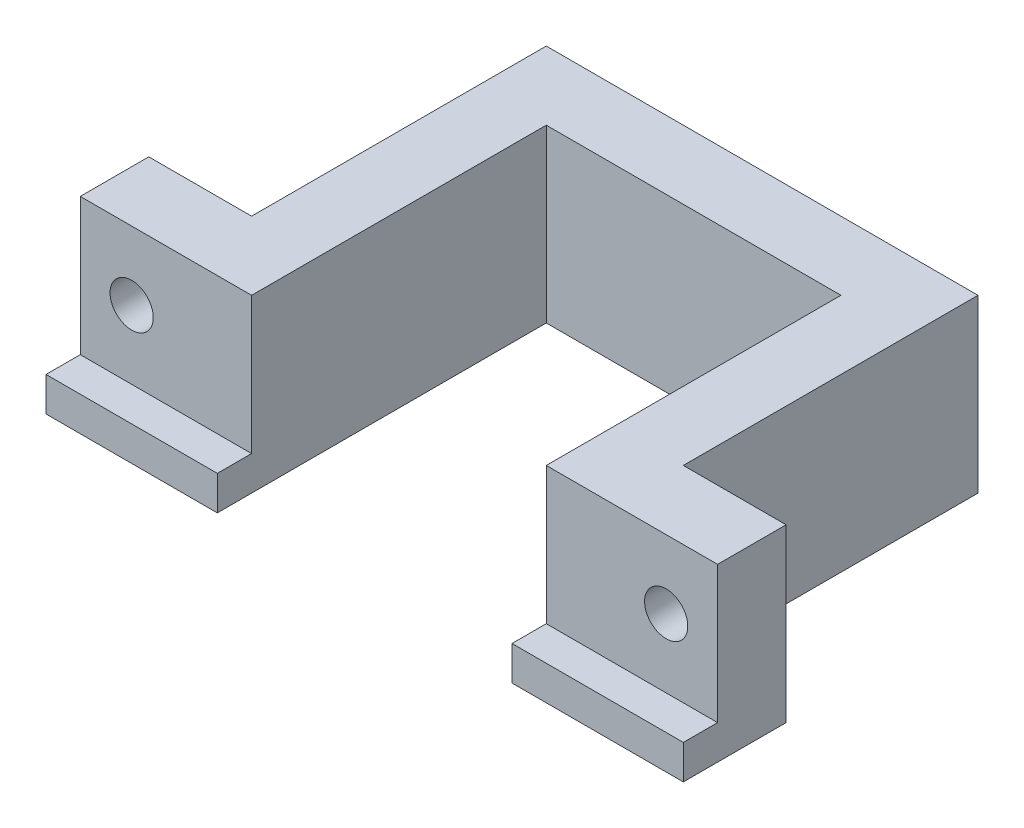
ISO-10303-21;
HEADER;
FILE_DESCRIPTION(('STEP AP214'),'2;1');
FILE_NAME('part.step','',(''),(''),'','','');
FILE_SCHEMA(('AUTOMOTIVE_DESIGN { 1 0 10303 214 1 1 1 1 }'));
ENDSEC;
DATA;
#1=APPLICATION_CONTEXT('core data for automotive mechanical design processes');
#2=APPLICATION_PROTOCOL_DEFINITION('international standard','automotive_design',2000,#1);
#3=PRODUCT_CONTEXT('',#1,'mechanical');
#4=PRODUCT('Part','Part','',(#3));
#5=PRODUCT_RELATED_PRODUCT_CATEGORY('part','',(#4));
#6=PRODUCT_DEFINITION_FORMATION('','',#4);
#7=PRODUCT_DEFINITION_CONTEXT('part definition',#1,'design');
#8=PRODUCT_DEFINITION('design','',#6,#7);
#9=PRODUCT_DEFINITION_SHAPE('','',#8);
#10=(LENGTH_UNIT() NAMED_UNIT(*) SI_UNIT(.MILLI.,.METRE.));
#11=(NAMED_UNIT(*) PLANE_ANGLE_UNIT() SI_UNIT($,.RADIAN.));
#12=(NAMED_UNIT(*) SI_UNIT($,.STERADIAN.) SOLID_ANGLE_UNIT());
#13=UNCERTAINTY_MEASURE_WITH_UNIT(LENGTH_MEASURE(1.E-05),#10,'distance_accuracy_value','');
#14=(GEOMETRIC_REPRESENTATION_CONTEXT(3) GLOBAL_UNCERTAINTY_ASSIGNED_CONTEXT((#13)) GLOBAL_UNIT_ASSIGNED_CONTEXT((#10,
#11,#12)) REPRESENTATION_CONTEXT('',''));
#15=CARTESIAN_POINT('',(0.,0.,0.));
#16=DIRECTION('',(0.,0.,1.));
#17=DIRECTION('',(1.,0.,0.));
#18=AXIS2_PLACEMENT_3D('',#15,#16,#17);
#19=CARTESIAN_POINT('',(60.5,10.,0.));
#20=DIRECTION('',(0.,0.,-1.));
#21=DIRECTION('',(-1.,0.,0.));
#22=AXIS2_PLACEMENT_3D('',#19,#20,#21);
#23=CYLINDRICAL_SURFACE('',#22,3.15);
#24=CARTESIAN_POINT('',(60.5,10.,0.));
#25=DIRECTION('',(0.,0.,-1.));
#26=DIRECTION('',(-1.,0.,0.));
#27=AXIS2_PLACEMENT_3D('',#24,#25,#26);
#28=CIRCLE('',#27,3.15);
#29=CARTESIAN_POINT('',(57.35,10.,0.));
#30=VERTEX_POINT('',#29);
#31=EDGE_CURVE('E234',#30,#30,#28,.T.);
#32=ORIENTED_EDGE('',*,*,#31,.F.);
#33=EDGE_LOOP('',(#32));
#34=FACE_BOUND('',#33,.T.);
#35=CARTESIAN_POINT('',(60.5,10.,-6.));
#36=DIRECTION('',(0.,0.,-1.));
#37=DIRECTION('',(-1.,0.,0.));
#38=AXIS2_PLACEMENT_3D('',#35,#36,#37);
#39=CIRCLE('',#38,3.15);
#40=CARTESIAN_POINT('',(57.35,10.,-6.));
#41=VERTEX_POINT('',#40);
#42=EDGE_CURVE('E37',#41,#41,#39,.F.);
#43=ORIENTED_EDGE('',*,*,#42,.F.);
#44=EDGE_LOOP('',(#43));
#45=FACE_BOUND('',#44,.T.);
#46=ADVANCED_FACE('F33',(#34,#45),#23,.F.);
#47=CARTESIAN_POINT('',(-17.5,10.,0.));
#48=DIRECTION('',(0.,0.,-1.));
#49=DIRECTION('',(-1.,0.,0.));
#50=AXIS2_PLACEMENT_3D('',#47,#48,#49);
#51=CYLINDRICAL_SURFACE('',#50,3.15);
#52=CARTESIAN_POINT('',(-17.5,10.,0.));
#53=DIRECTION('',(0.,0.,-1.));
#54=DIRECTION('',(-1.,0.,0.));
#55=AXIS2_PLACEMENT_3D('',#52,#53,#54);
#56=CIRCLE('',#55,3.15);
#57=CARTESIAN_POINT('',(-20.65,10.,0.));
#58=VERTEX_POINT('',#57);
#59=EDGE_CURVE('E231',#58,#58,#56,.T.);
#60=ORIENTED_EDGE('',*,*,#59,.F.);
#61=EDGE_LOOP('',(#60));
#62=FACE_BOUND('',#61,.T.);
#63=CARTESIAN_POINT('',(-17.5,10.,-6.));
#64=DIRECTION('',(0.,0.,-1.));
#65=DIRECTION('',(-1.,0.,0.));
#66=AXIS2_PLACEMENT_3D('',#63,#64,#65);
#67=CIRCLE('',#66,3.15);
#68=CARTESIAN_POINT('',(-20.65,10.,-6.));
#69=VERTEX_POINT('',#68);
#70=EDGE_CURVE('E227',#69,#69,#67,.F.);
#71=ORIENTED_EDGE('',*,*,#70,.F.);
#72=EDGE_LOOP('',(#71));
#73=FACE_BOUND('',#72,.T.);
#74=ADVANCED_FACE('F290',(#62,#73),#51,.F.);
#75=CARTESIAN_POINT('',(-25.,20.,0.));
#76=DIRECTION('',(0.,0.,-1.));
#77=DIRECTION('',(-1.,0.,0.));
#78=AXIS2_PLACEMENT_3D('',#75,#76,#77);
#79=PLANE('',#78);
#80=ORIENTED_EDGE('',*,*,#59,.T.);
#81=EDGE_LOOP('',(#80));
#82=FACE_BOUND('',#81,.T.);
#83=DIRECTION('',(1.,0.,0.));
#84=VECTOR('',#83,1.);
#85=CARTESIAN_POINT('',(-25.,0.,0.));
#86=LINE('',#85,#84);
#87=CARTESIAN_POINT('',(-25.,0.,0.));
#88=VERTEX_POINT('',#87);
#89=CARTESIAN_POINT('',(0.,0.,0.));
#90=VERTEX_POINT('',#89);
#91=EDGE_CURVE('E237',#88,#90,#86,.T.);
#92=ORIENTED_EDGE('',*,*,#91,.T.);
#93=DIRECTION('',(0.,-1.,0.));
#94=VECTOR('',#93,1.);
#95=CARTESIAN_POINT('',(0.,20.,0.));
#96=LINE('',#95,#94);
#97=CARTESIAN_POINT('',(0.,20.,0.));
#98=VERTEX_POINT('',#97);
#99=EDGE_CURVE('E11',#98,#90,#96,.T.);
#100=ORIENTED_EDGE('',*,*,#99,.F.);
#101=DIRECTION('',(1.,0.,0.));
#102=VECTOR('',#101,1.);
#103=CARTESIAN_POINT('',(-25.,20.,0.));
#104=LINE('',#103,#102);
#105=CARTESIAN_POINT('',(-25.,20.,0.));
#106=VERTEX_POINT('',#105);
#107=EDGE_CURVE('E238',#106,#98,#104,.T.);
#108=ORIENTED_EDGE('',*,*,#107,.F.);
#109=DIRECTION('',(0.,-1.,0.));
#110=VECTOR('',#109,1.);
#111=CARTESIAN_POINT('',(-25.,20.,0.));
#112=LINE('',#111,#110);
#113=EDGE_CURVE('E153',#106,#88,#112,.T.);
#114=ORIENTED_EDGE('',*,*,#113,.T.);
#115=EDGE_LOOP('',(#92,#100,#108,#114));
#116=FACE_BOUND('',#115,.T.);
#117=ADVANCED_FACE('F35',(#82,#116),#79,.F.);
#118=CARTESIAN_POINT('',(0.,20.,0.));
#119=DIRECTION('',(-1.,0.,0.));
#120=DIRECTION('',(0.,0.,1.));
#121=AXIS2_PLACEMENT_3D('',#118,#119,#120);
#122=PLANE('',#121);
#123=ORIENTED_EDGE('',*,*,#99,.T.);
#124=DIRECTION('',(0.,0.,1.));
#125=VECTOR('',#124,1.);
#126=CARTESIAN_POINT('',(0.,0.,-43.));
#127=LINE('',#126,#125);
#128=CARTESIAN_POINT('',(0.,0.,5.));
#129=VERTEX_POINT('',#128);
#130=EDGE_CURVE('E170',#90,#129,#127,.T.);
#131=ORIENTED_EDGE('',*,*,#130,.T.);
#132=DIRECTION('',(0.,1.,0.));
#133=VECTOR('',#132,1.);
#134=CARTESIAN_POINT('',(0.,-5.,5.));
#135=LINE('',#134,#133);
#136=CARTESIAN_POINT('',(0.,-5.,5.));
#137=VERTEX_POINT('',#136);
#138=EDGE_CURVE('E209',#137,#129,#135,.T.);
#139=ORIENTED_EDGE('',*,*,#138,.F.);
#140=DIRECTION('',(0.,0.,1.));
#141=VECTOR('',#140,1.);
#142=CARTESIAN_POINT('',(0.,-5.,-43.));
#143=LINE('',#142,#141);
#144=CARTESIAN_POINT('',(0.,-5.,-43.));
#145=VERTEX_POINT('',#144);
#146=EDGE_CURVE('E193',#145,#137,#143,.T.);
#147=ORIENTED_EDGE('',*,*,#146,.F.);
#148=DIRECTION('',(0.,-1.,0.));
#149=VECTOR('',#148,1.);
#150=CARTESIAN_POINT('',(0.,20.,-43.));
#151=LINE('',#150,#149);
#152=CARTESIAN_POINT('',(0.,20.,-43.));
#153=VERTEX_POINT('',#152);
#154=EDGE_CURVE('E43',#153,#145,#151,.T.);
#155=ORIENTED_EDGE('',*,*,#154,.F.);
#156=DIRECTION('',(0.,0.,-1.));
#157=VECTOR('',#156,1.);
#158=CARTESIAN_POINT('',(0.,20.,0.));
#159=LINE('',#158,#157);
#160=EDGE_CURVE('E240',#98,#153,#159,.T.);
#161=ORIENTED_EDGE('',*,*,#160,.F.);
#162=EDGE_LOOP('',(#123,#131,#139,#147,#155,#161));
#163=FACE_BOUND('',#162,.T.);
#164=ADVANCED_FACE('F298',(#163),#122,.F.);
#165=CARTESIAN_POINT('',(0.,20.,-43.));
#166=DIRECTION('',(0.,0.,-1.));
#167=DIRECTION('',(-1.,0.,0.));
#168=AXIS2_PLACEMENT_3D('',#165,#166,#167);
#169=PLANE('',#168);
#170=ORIENTED_EDGE('',*,*,#154,.T.);
#171=DIRECTION('',(-1.,0.,0.));
#172=VECTOR('',#171,1.);
#173=CARTESIAN_POINT('',(43.,-5.,-43.));
#174=LINE('',#173,#172);
#175=CARTESIAN_POINT('',(43.,-5.,-43.));
#176=VERTEX_POINT('',#175);
#177=EDGE_CURVE('E190',#176,#145,#174,.T.);
#178=ORIENTED_EDGE('',*,*,#177,.F.);
#179=DIRECTION('',(0.,-1.,0.));
#180=VECTOR('',#179,1.);
#181=CARTESIAN_POINT('',(43.,20.,-43.));
#182=LINE('',#181,#180);
#183=CARTESIAN_POINT('',(43.,20.,-43.));
#184=VERTEX_POINT('',#183);
#185=EDGE_CURVE('E283',#184,#176,#182,.T.);
#186=ORIENTED_EDGE('',*,*,#185,.F.);
#187=DIRECTION('',(1.,0.,0.));
#188=VECTOR('',#187,1.);
#189=CARTESIAN_POINT('',(0.,20.,-43.));
#190=LINE('',#189,#188);
#191=EDGE_CURVE('E243',#153,#184,#190,.T.);
#192=ORIENTED_EDGE('',*,*,#191,.F.);
#193=EDGE_LOOP('',(#170,#178,#186,#192));
#194=FACE_BOUND('',#193,.T.);
#195=ADVANCED_FACE('F342',(#194),#169,.F.);
#196=CARTESIAN_POINT('',(43.,20.,-43.));
#197=DIRECTION('',(1.,0.,0.));
#198=DIRECTION('',(0.,0.,-1.));
#199=AXIS2_PLACEMENT_3D('',#196,#197,#198);
#200=PLANE('',#199);
#201=ORIENTED_EDGE('',*,*,#185,.T.);
#202=DIRECTION('',(0.,0.,-1.));
#203=VECTOR('',#202,1.);
#204=CARTESIAN_POINT('',(43.,-5.,5.));
#205=LINE('',#204,#203);
#206=CARTESIAN_POINT('',(43.,-5.,5.));
#207=VERTEX_POINT('',#206);
#208=EDGE_CURVE('E187',#207,#176,#205,.T.);
#209=ORIENTED_EDGE('',*,*,#208,.F.);
#210=DIRECTION('',(0.,1.,0.));
#211=VECTOR('',#210,1.);
#212=CARTESIAN_POINT('',(43.,-5.,5.));
#213=LINE('',#212,#211);
#214=CARTESIAN_POINT('',(43.,0.,5.));
#215=VERTEX_POINT('',#214);
#216=EDGE_CURVE('E212',#207,#215,#213,.T.);
#217=ORIENTED_EDGE('',*,*,#216,.T.);
#218=DIRECTION('',(0.,0.,-1.));
#219=VECTOR('',#218,1.);
#220=CARTESIAN_POINT('',(43.,0.,5.));
#221=LINE('',#220,#219);
#222=CARTESIAN_POINT('',(43.,0.,0.));
#223=VERTEX_POINT('',#222);
#224=EDGE_CURVE('E204',#215,#223,#221,.T.);
#225=ORIENTED_EDGE('',*,*,#224,.T.);
#226=DIRECTION('',(0.,-1.,0.));
#227=VECTOR('',#226,1.);
#228=CARTESIAN_POINT('',(43.,20.,0.));
#229=LINE('',#228,#227);
#230=CARTESIAN_POINT('',(43.,20.,0.));
#231=VERTEX_POINT('',#230);
#232=EDGE_CURVE('E280',#231,#223,#229,.T.);
#233=ORIENTED_EDGE('',*,*,#232,.F.);
#234=DIRECTION('',(0.,0.,1.));
#235=VECTOR('',#234,1.);
#236=CARTESIAN_POINT('',(43.,20.,-43.));
#237=LINE('',#236,#235);
#238=EDGE_CURVE('E245',#184,#231,#237,.T.);
#239=ORIENTED_EDGE('',*,*,#238,.F.);
#240=EDGE_LOOP('',(#201,#209,#217,#225,#233,#239));
#241=FACE_BOUND('',#240,.T.);
#242=ADVANCED_FACE('F338',(#241),#200,.F.);
#243=CARTESIAN_POINT('',(43.,20.,0.));
#244=DIRECTION('',(0.,0.,-1.));
#245=DIRECTION('',(-1.,0.,0.));
#246=AXIS2_PLACEMENT_3D('',#243,#244,#245);
#247=PLANE('',#246);
#248=ORIENTED_EDGE('',*,*,#31,.T.);
#249=EDGE_LOOP('',(#248));
#250=FACE_BOUND('',#249,.T.);
#251=DIRECTION('',(1.,0.,0.));
#252=VECTOR('',#251,1.);
#253=CARTESIAN_POINT('',(43.,0.,0.));
#254=LINE('',#253,#252);
#255=CARTESIAN_POINT('',(68.,0.,0.));
#256=VERTEX_POINT('',#255);
#257=EDGE_CURVE('E241',#223,#256,#254,.T.);
#258=ORIENTED_EDGE('',*,*,#257,.T.);
#259=DIRECTION('',(0.,-1.,0.));
#260=VECTOR('',#259,1.);
#261=CARTESIAN_POINT('',(68.,20.,0.));
#262=LINE('',#261,#260);
#263=CARTESIAN_POINT('',(68.,20.,0.));
#264=VERTEX_POINT('',#263);
#265=EDGE_CURVE('E277',#264,#256,#262,.T.);
#266=ORIENTED_EDGE('',*,*,#265,.F.);
#267=DIRECTION('',(1.,0.,0.));
#268=VECTOR('',#267,1.);
#269=CARTESIAN_POINT('',(43.,20.,0.));
#270=LINE('',#269,#268);
#271=EDGE_CURVE('E247',#231,#264,#270,.T.);
#272=ORIENTED_EDGE('',*,*,#271,.F.);
#273=ORIENTED_EDGE('',*,*,#232,.T.);
#274=EDGE_LOOP('',(#258,#266,#272,#273));
#275=FACE_BOUND('',#274,.T.);
#276=ADVANCED_FACE('F334',(#250,#275),#247,.F.);
#277=CARTESIAN_POINT('',(68.,20.,0.));
#278=DIRECTION('',(-1.,0.,0.));
#279=DIRECTION('',(0.,0.,1.));
#280=AXIS2_PLACEMENT_3D('',#277,#278,#279);
#281=PLANE('',#280);
#282=ORIENTED_EDGE('',*,*,#265,.T.);
#283=DIRECTION('',(0.,0.,1.));
#284=VECTOR('',#283,1.);
#285=CARTESIAN_POINT('',(68.,0.,-10.));
#286=LINE('',#285,#284);
#287=CARTESIAN_POINT('',(68.,0.,5.));
#288=VERTEX_POINT('',#287);
#289=EDGE_CURVE('E200',#256,#288,#286,.T.);
#290=ORIENTED_EDGE('',*,*,#289,.T.);
#291=DIRECTION('',(0.,1.,0.));
#292=VECTOR('',#291,1.);
#293=CARTESIAN_POINT('',(68.,-5.,5.));
#294=LINE('',#293,#292);
#295=CARTESIAN_POINT('',(68.,-5.,5.));
#296=VERTEX_POINT('',#295);
#297=EDGE_CURVE('E215',#296,#288,#294,.T.);
#298=ORIENTED_EDGE('',*,*,#297,.F.);
#299=DIRECTION('',(0.,0.,1.));
#300=VECTOR('',#299,1.);
#301=CARTESIAN_POINT('',(68.,-5.,-10.));
#302=LINE('',#301,#300);
#303=CARTESIAN_POINT('',(68.,-5.,-10.));
#304=VERTEX_POINT('',#303);
#305=EDGE_CURVE('E183',#304,#296,#302,.T.);
#306=ORIENTED_EDGE('',*,*,#305,.F.);
#307=DIRECTION('',(0.,-1.,0.));
#308=VECTOR('',#307,1.);
#309=CARTESIAN_POINT('',(68.,20.,-10.));
#310=LINE('',#309,#308);
#311=CARTESIAN_POINT('',(68.,20.,-10.));
#312=VERTEX_POINT('',#311);
#313=EDGE_CURVE('E275',#312,#304,#310,.T.);
#314=ORIENTED_EDGE('',*,*,#313,.F.);
#315=DIRECTION('',(0.,0.,-1.));
#316=VECTOR('',#315,1.);
#317=CARTESIAN_POINT('',(68.,20.,0.));
#318=LINE('',#317,#316);
#319=EDGE_CURVE('E249',#264,#312,#318,.T.);
#320=ORIENTED_EDGE('',*,*,#319,.F.);
#321=EDGE_LOOP('',(#282,#290,#298,#306,#314,#320));
#322=FACE_BOUND('',#321,.T.);
#323=ADVANCED_FACE('F330',(#322),#281,.F.);
#324=CARTESIAN_POINT('',(68.,20.,-10.));
#325=DIRECTION('',(0.,0.,1.));
#326=DIRECTION('',(1.,0.,0.));
#327=AXIS2_PLACEMENT_3D('',#324,#325,#326);
#328=PLANE('',#327);
#329=CARTESIAN_POINT('',(60.5,10.,-10.));
#330=DIRECTION('',(0.,0.,-1.));
#331=DIRECTION('',(-1.,0.,0.));
#332=AXIS2_PLACEMENT_3D('',#329,#330,#331);
#333=CIRCLE('',#332,4.25);
#334=CARTESIAN_POINT('',(56.25,10.,-10.));
#335=VERTEX_POINT('',#334);
#336=EDGE_CURVE('E218',#335,#335,#333,.T.);
#337=ORIENTED_EDGE('',*,*,#336,.F.);
#338=EDGE_LOOP('',(#337));
#339=FACE_BOUND('',#338,.T.);
#340=ORIENTED_EDGE('',*,*,#313,.T.);
#341=DIRECTION('',(1.,0.,0.));
#342=VECTOR('',#341,1.);
#343=CARTESIAN_POINT('',(53.,-5.,-10.));
#344=LINE('',#343,#342);
#345=CARTESIAN_POINT('',(53.,-5.,-10.));
#346=VERTEX_POINT('',#345);
#347=EDGE_CURVE('E180',#346,#304,#344,.T.);
#348=ORIENTED_EDGE('',*,*,#347,.F.);
#349=DIRECTION('',(0.,-1.,0.));
#350=VECTOR('',#349,1.);
#351=CARTESIAN_POINT('',(53.,20.,-10.));
#352=LINE('',#351,#350);
#353=CARTESIAN_POINT('',(53.,20.,-10.));
#354=VERTEX_POINT('',#353);
#355=EDGE_CURVE('E273',#354,#346,#352,.T.);
#356=ORIENTED_EDGE('',*,*,#355,.F.);
#357=DIRECTION('',(-1.,0.,0.));
#358=VECTOR('',#357,1.);
#359=CARTESIAN_POINT('',(68.,20.,-10.));
#360=LINE('',#359,#358);
#361=EDGE_CURVE('E251',#312,#354,#360,.T.);
#362=ORIENTED_EDGE('',*,*,#361,.F.);
#363=EDGE_LOOP('',(#340,#348,#356,#362));
#364=FACE_BOUND('',#363,.T.);
#365=ADVANCED_FACE('F326',(#339,#364),#328,.F.);
#366=CARTESIAN_POINT('',(53.,20.,-10.));
#367=DIRECTION('',(-1.,0.,0.));
#368=DIRECTION('',(0.,0.,1.));
#369=AXIS2_PLACEMENT_3D('',#366,#367,#368);
#370=PLANE('',#369);
#371=ORIENTED_EDGE('',*,*,#355,.T.);
#372=DIRECTION('',(0.,0.,1.));
#373=VECTOR('',#372,1.);
#374=CARTESIAN_POINT('',(53.,-5.,-53.));
#375=LINE('',#374,#373);
#376=CARTESIAN_POINT('',(53.,-5.,-53.));
#377=VERTEX_POINT('',#376);
#378=EDGE_CURVE('E177',#377,#346,#375,.T.);
#379=ORIENTED_EDGE('',*,*,#378,.F.);
#380=DIRECTION('',(0.,-1.,0.));
#381=VECTOR('',#380,1.);
#382=CARTESIAN_POINT('',(53.,20.,-53.));
#383=LINE('',#382,#381);
#384=CARTESIAN_POINT('',(53.,20.,-53.));
#385=VERTEX_POINT('',#384);
#386=EDGE_CURVE('E271',#385,#377,#383,.T.);
#387=ORIENTED_EDGE('',*,*,#386,.F.);
#388=DIRECTION('',(0.,0.,-1.));
#389=VECTOR('',#388,1.);
#390=CARTESIAN_POINT('',(53.,20.,-10.));
#391=LINE('',#390,#389);
#392=EDGE_CURVE('E253',#354,#385,#391,.T.);
#393=ORIENTED_EDGE('',*,*,#392,.F.);
#394=EDGE_LOOP('',(#371,#379,#387,#393));
#395=FACE_BOUND('',#394,.T.);
#396=ADVANCED_FACE('F322',(#395),#370,.F.);
#397=CARTESIAN_POINT('',(53.,20.,-53.));
#398=DIRECTION('',(0.,0.,1.));
#399=DIRECTION('',(1.,0.,0.));
#400=AXIS2_PLACEMENT_3D('',#397,#398,#399);
#401=PLANE('',#400);
#402=ORIENTED_EDGE('',*,*,#386,.T.);
#403=DIRECTION('',(1.,0.,0.));
#404=VECTOR('',#403,1.);
#405=CARTESIAN_POINT('',(-10.,-5.,-53.));
#406=LINE('',#405,#404);
#407=CARTESIAN_POINT('',(-10.,-5.,-53.));
#408=VERTEX_POINT('',#407);
#409=EDGE_CURVE('E174',#408,#377,#406,.T.);
#410=ORIENTED_EDGE('',*,*,#409,.F.);
#411=DIRECTION('',(0.,-1.,0.));
#412=VECTOR('',#411,1.);
#413=CARTESIAN_POINT('',(-10.,20.,-53.));
#414=LINE('',#413,#412);
#415=CARTESIAN_POINT('',(-10.,20.,-53.));
#416=VERTEX_POINT('',#415);
#417=EDGE_CURVE('E269',#416,#408,#414,.T.);
#418=ORIENTED_EDGE('',*,*,#417,.F.);
#419=DIRECTION('',(-1.,0.,0.));
#420=VECTOR('',#419,1.);
#421=CARTESIAN_POINT('',(53.,20.,-53.));
#422=LINE('',#421,#420);
#423=EDGE_CURVE('E255',#385,#416,#422,.T.);
#424=ORIENTED_EDGE('',*,*,#423,.F.);
#425=EDGE_LOOP('',(#402,#410,#418,#424));
#426=FACE_BOUND('',#425,.T.);
#427=ADVANCED_FACE('F318',(#426),#401,.F.);
#428=CARTESIAN_POINT('',(-10.,20.,-53.));
#429=DIRECTION('',(1.,0.,0.));
#430=DIRECTION('',(0.,0.,-1.));
#431=AXIS2_PLACEMENT_3D('',#428,#429,#430);
#432=PLANE('',#431);
#433=ORIENTED_EDGE('',*,*,#417,.T.);
#434=DIRECTION('',(0.,0.,-1.));
#435=VECTOR('',#434,1.);
#436=CARTESIAN_POINT('',(-10.,-5.,-10.));
#437=LINE('',#436,#435);
#438=CARTESIAN_POINT('',(-10.,-5.,-10.));
#439=VERTEX_POINT('',#438);
#440=EDGE_CURVE('E162',#439,#408,#437,.T.);
#441=ORIENTED_EDGE('',*,*,#440,.F.);
#442=DIRECTION('',(0.,-1.,0.));
#443=VECTOR('',#442,1.);
#444=CARTESIAN_POINT('',(-10.,20.,-10.));
#445=LINE('',#444,#443);
#446=CARTESIAN_POINT('',(-10.,20.,-10.));
#447=VERTEX_POINT('',#446);
#448=EDGE_CURVE('E152',#447,#439,#445,.T.);
#449=ORIENTED_EDGE('',*,*,#448,.F.);
#450=DIRECTION('',(0.,0.,1.));
#451=VECTOR('',#450,1.);
#452=CARTESIAN_POINT('',(-10.,20.,-53.));
#453=LINE('',#452,#451);
#454=EDGE_CURVE('E257',#416,#447,#453,.T.);
#455=ORIENTED_EDGE('',*,*,#454,.F.);
#456=EDGE_LOOP('',(#433,#441,#449,#455));
#457=FACE_BOUND('',#456,.T.);
#458=ADVANCED_FACE('F314',(#457),#432,.F.);
#459=CARTESIAN_POINT('',(-10.,20.,-10.));
#460=DIRECTION('',(0.,0.,1.));
#461=DIRECTION('',(1.,0.,0.));
#462=AXIS2_PLACEMENT_3D('',#459,#460,#461);
#463=PLANE('',#462);
#464=CARTESIAN_POINT('',(-17.5,10.,-10.));
#465=DIRECTION('',(0.,0.,-1.));
#466=DIRECTION('',(-1.,0.,0.));
#467=AXIS2_PLACEMENT_3D('',#464,#465,#466);
#468=CIRCLE('',#467,4.25);
#469=CARTESIAN_POINT('',(-21.75,10.,-10.));
#470=VERTEX_POINT('',#469);
#471=EDGE_CURVE('E228',#470,#470,#468,.T.);
#472=ORIENTED_EDGE('',*,*,#471,.F.);
#473=EDGE_LOOP('',(#472));
#474=FACE_BOUND('',#473,.T.);
#475=ORIENTED_EDGE('',*,*,#448,.T.);
#476=DIRECTION('',(1.,0.,0.));
#477=VECTOR('',#476,1.);
#478=CARTESIAN_POINT('',(-25.,-5.,-10.));
#479=LINE('',#478,#477);
#480=CARTESIAN_POINT('',(-25.,-5.,-10.));
#481=VERTEX_POINT('',#480);
#482=EDGE_CURVE('E156',#481,#439,#479,.T.);
#483=ORIENTED_EDGE('',*,*,#482,.F.);
#484=DIRECTION('',(0.,-1.,0.));
#485=VECTOR('',#484,1.);
#486=CARTESIAN_POINT('',(-25.,20.,-10.));
#487=LINE('',#486,#485);
#488=CARTESIAN_POINT('',(-25.,20.,-10.));
#489=VERTEX_POINT('',#488);
#490=EDGE_CURVE('E144',#489,#481,#487,.T.);
#491=ORIENTED_EDGE('',*,*,#490,.F.);
#492=DIRECTION('',(-1.,0.,0.));
#493=VECTOR('',#492,1.);
#494=CARTESIAN_POINT('',(-10.,20.,-10.));
#495=LINE('',#494,#493);
#496=EDGE_CURVE('E259',#447,#489,#495,.T.);
#497=ORIENTED_EDGE('',*,*,#496,.F.);
#498=EDGE_LOOP('',(#475,#483,#491,#497));
#499=FACE_BOUND('',#498,.T.);
#500=ADVANCED_FACE('F157',(#474,#499),#463,.F.);
#501=CARTESIAN_POINT('',(-25.,20.,-10.));
#502=DIRECTION('',(1.,0.,0.));
#503=DIRECTION('',(0.,0.,-1.));
#504=AXIS2_PLACEMENT_3D('',#501,#502,#503);
#505=PLANE('',#504);
#506=ORIENTED_EDGE('',*,*,#490,.T.);
#507=DIRECTION('',(0.,0.,-1.));
#508=VECTOR('',#507,1.);
#509=CARTESIAN_POINT('',(-25.,-5.,5.));
#510=LINE('',#509,#508);
#511=CARTESIAN_POINT('',(-25.,-5.,5.));
#512=VERTEX_POINT('',#511);
#513=EDGE_CURVE('E149',#512,#481,#510,.T.);
#514=ORIENTED_EDGE('',*,*,#513,.F.);
#515=DIRECTION('',(0.,1.,0.));
#516=VECTOR('',#515,1.);
#517=CARTESIAN_POINT('',(-25.,-5.,5.));
#518=LINE('',#517,#516);
#519=CARTESIAN_POINT('',(-25.,0.,5.));
#520=VERTEX_POINT('',#519);
#521=EDGE_CURVE('E196',#512,#520,#518,.T.);
#522=ORIENTED_EDGE('',*,*,#521,.T.);
#523=DIRECTION('',(0.,0.,-1.));
#524=VECTOR('',#523,1.);
#525=CARTESIAN_POINT('',(-25.,0.,5.));
#526=LINE('',#525,#524);
#527=EDGE_CURVE('E197',#520,#88,#526,.T.);
#528=ORIENTED_EDGE('',*,*,#527,.T.);
#529=ORIENTED_EDGE('',*,*,#113,.F.);
#530=DIRECTION('',(0.,0.,1.));
#531=VECTOR('',#530,1.);
#532=CARTESIAN_POINT('',(-25.,20.,-10.));
#533=LINE('',#532,#531);
#534=EDGE_CURVE('E51',#489,#106,#533,.T.);
#535=ORIENTED_EDGE('',*,*,#534,.F.);
#536=EDGE_LOOP('',(#506,#514,#522,#528,#529,#535));
#537=FACE_BOUND('',#536,.T.);
#538=ADVANCED_FACE('F146',(#537),#505,.F.);
#539=CARTESIAN_POINT('',(0.,20.,0.));
#540=DIRECTION('',(0.,1.,0.));
#541=DIRECTION('',(0.,0.,1.));
#542=AXIS2_PLACEMENT_3D('',#539,#540,#541);
#543=PLANE('',#542);
#544=ORIENTED_EDGE('',*,*,#107,.T.);
#545=ORIENTED_EDGE('',*,*,#160,.T.);
#546=ORIENTED_EDGE('',*,*,#191,.T.);
#547=ORIENTED_EDGE('',*,*,#238,.T.);
#548=ORIENTED_EDGE('',*,*,#271,.T.);
#549=ORIENTED_EDGE('',*,*,#319,.T.);
#550=ORIENTED_EDGE('',*,*,#361,.T.);
#551=ORIENTED_EDGE('',*,*,#392,.T.);
#552=ORIENTED_EDGE('',*,*,#423,.T.);
#553=ORIENTED_EDGE('',*,*,#454,.T.);
#554=ORIENTED_EDGE('',*,*,#496,.T.);
#555=ORIENTED_EDGE('',*,*,#534,.T.);
#556=EDGE_LOOP('',(#544,#545,#546,#547,#548,#549,#550,#551,#552,#553,#554,#555));
#557=FACE_BOUND('',#556,.T.);
#558=ADVANCED_FACE('F307',(#557),#543,.T.);
#559=CARTESIAN_POINT('',(-17.5,10.,-6.));
#560=DIRECTION('',(0.,0.,-1.));
#561=DIRECTION('',(-1.,0.,0.));
#562=AXIS2_PLACEMENT_3D('',#559,#560,#561);
#563=PLANE('',#562);
#564=CARTESIAN_POINT('',(-17.5,10.,-6.));
#565=DIRECTION('',(0.,0.,-1.));
#566=DIRECTION('',(-1.,0.,0.));
#567=AXIS2_PLACEMENT_3D('',#564,#565,#566);
#568=CIRCLE('',#567,4.25);
#569=CARTESIAN_POINT('',(-21.75,10.,-6.));
#570=VERTEX_POINT('',#569);
#571=EDGE_CURVE('E224',#570,#570,#568,.T.);
#572=ORIENTED_EDGE('',*,*,#571,.T.);
#573=EDGE_LOOP('',(#572));
#574=FACE_BOUND('',#573,.T.);
#575=ORIENTED_EDGE('',*,*,#70,.T.);
#576=EDGE_LOOP('',(#575));
#577=FACE_BOUND('',#576,.T.);
#578=ADVANCED_FACE('F288',(#574,#577),#563,.T.);
#579=CARTESIAN_POINT('',(-17.5,10.,-6.));
#580=DIRECTION('',(0.,0.,-1.));
#581=DIRECTION('',(-1.,0.,0.));
#582=AXIS2_PLACEMENT_3D('',#579,#580,#581);
#583=CYLINDRICAL_SURFACE('',#582,4.25);
#584=ORIENTED_EDGE('',*,*,#571,.F.);
#585=EDGE_LOOP('',(#584));
#586=FACE_BOUND('',#585,.T.);
#587=ORIENTED_EDGE('',*,*,#471,.T.);
#588=EDGE_LOOP('',(#587));
#589=FACE_BOUND('',#588,.T.);
#590=ADVANCED_FACE('F304',(#586,#589),#583,.F.);
#591=CARTESIAN_POINT('',(60.5,10.,-6.));
#592=DIRECTION('',(0.,0.,-1.));
#593=DIRECTION('',(-1.,0.,0.));
#594=AXIS2_PLACEMENT_3D('',#591,#592,#593);
#595=PLANE('',#594);
#596=CARTESIAN_POINT('',(60.5,10.,-6.));
#597=DIRECTION('',(0.,0.,-1.));
#598=DIRECTION('',(-1.,0.,0.));
#599=AXIS2_PLACEMENT_3D('',#596,#597,#598);
#600=CIRCLE('',#599,4.25);
#601=CARTESIAN_POINT('',(56.25,10.,-6.));
#602=VERTEX_POINT('',#601);
#603=EDGE_CURVE('E219',#602,#602,#600,.T.);
#604=ORIENTED_EDGE('',*,*,#603,.T.);
#605=EDGE_LOOP('',(#604));
#606=FACE_BOUND('',#605,.T.);
#607=ORIENTED_EDGE('',*,*,#42,.T.);
#608=EDGE_LOOP('',(#607));
#609=FACE_BOUND('',#608,.T.);
#610=ADVANCED_FACE('F409',(#606,#609),#595,.T.);
#611=CARTESIAN_POINT('',(60.5,10.,-6.));
#612=DIRECTION('',(0.,0.,-1.));
#613=DIRECTION('',(-1.,0.,0.));
#614=AXIS2_PLACEMENT_3D('',#611,#612,#613);
#615=CYLINDRICAL_SURFACE('',#614,4.25);
#616=ORIENTED_EDGE('',*,*,#603,.F.);
#617=EDGE_LOOP('',(#616));
#618=FACE_BOUND('',#617,.T.);
#619=ORIENTED_EDGE('',*,*,#336,.T.);
#620=EDGE_LOOP('',(#619));
#621=FACE_BOUND('',#620,.T.);
#622=ADVANCED_FACE('F403',(#618,#621),#615,.F.);
#623=CARTESIAN_POINT('',(0.,0.,0.));
#624=DIRECTION('',(0.,-1.,0.));
#625=DIRECTION('',(0.,0.,-1.));
#626=AXIS2_PLACEMENT_3D('',#623,#624,#625);
#627=PLANE('',#626);
#628=ORIENTED_EDGE('',*,*,#91,.F.);
#629=ORIENTED_EDGE('',*,*,#527,.F.);
#630=DIRECTION('',(-1.,0.,0.));
#631=VECTOR('',#630,1.);
#632=CARTESIAN_POINT('',(-25.,0.,5.));
#633=LINE('',#632,#631);
#634=EDGE_CURVE('E168',#129,#520,#633,.T.);
#635=ORIENTED_EDGE('',*,*,#634,.F.);
#636=ORIENTED_EDGE('',*,*,#130,.F.);
#637=EDGE_LOOP('',(#628,#629,#635,#636));
#638=FACE_BOUND('',#637,.T.);
#639=ADVANCED_FACE('F357',(#638),#627,.F.);
#640=CARTESIAN_POINT('',(43.,-5.,5.));
#641=DIRECTION('',(0.,0.,-1.));
#642=DIRECTION('',(-1.,0.,0.));
#643=AXIS2_PLACEMENT_3D('',#640,#641,#642);
#644=PLANE('',#643);
#645=DIRECTION('',(-1.,0.,0.));
#646=VECTOR('',#645,1.);
#647=CARTESIAN_POINT('',(43.,0.,5.));
#648=LINE('',#647,#646);
#649=EDGE_CURVE('E202',#288,#215,#648,.T.);
#650=ORIENTED_EDGE('',*,*,#649,.T.);
#651=ORIENTED_EDGE('',*,*,#216,.F.);
#652=DIRECTION('',(-1.,0.,0.));
#653=VECTOR('',#652,1.);
#654=CARTESIAN_POINT('',(43.,-5.,5.));
#655=LINE('',#654,#653);
#656=EDGE_CURVE('E185',#296,#207,#655,.T.);
#657=ORIENTED_EDGE('',*,*,#656,.F.);
#658=ORIENTED_EDGE('',*,*,#297,.T.);
#659=EDGE_LOOP('',(#650,#651,#657,#658));
#660=FACE_BOUND('',#659,.T.);
#661=ADVANCED_FACE('F392',(#660),#644,.F.);
#662=CARTESIAN_POINT('',(-25.,-5.,5.));
#663=DIRECTION('',(0.,0.,-1.));
#664=DIRECTION('',(-1.,0.,0.));
#665=AXIS2_PLACEMENT_3D('',#662,#663,#664);
#666=PLANE('',#665);
#667=ORIENTED_EDGE('',*,*,#634,.T.);
#668=ORIENTED_EDGE('',*,*,#521,.F.);
#669=DIRECTION('',(-1.,0.,0.));
#670=VECTOR('',#669,1.);
#671=CARTESIAN_POINT('',(-25.,-5.,5.));
#672=LINE('',#671,#670);
#673=EDGE_CURVE('E166',#137,#512,#672,.T.);
#674=ORIENTED_EDGE('',*,*,#673,.F.);
#675=ORIENTED_EDGE('',*,*,#138,.T.);
#676=EDGE_LOOP('',(#667,#668,#674,#675));
#677=FACE_BOUND('',#676,.T.);
#678=ADVANCED_FACE('F360',(#677),#666,.F.);
#679=CARTESIAN_POINT('',(0.,-5.,0.));
#680=DIRECTION('',(0.,-1.,0.));
#681=DIRECTION('',(0.,0.,-1.));
#682=AXIS2_PLACEMENT_3D('',#679,#680,#681);
#683=PLANE('',#682);
#684=ORIENTED_EDGE('',*,*,#513,.T.);
#685=ORIENTED_EDGE('',*,*,#482,.T.);
#686=ORIENTED_EDGE('',*,*,#440,.T.);
#687=ORIENTED_EDGE('',*,*,#409,.T.);
#688=ORIENTED_EDGE('',*,*,#378,.T.);
#689=ORIENTED_EDGE('',*,*,#347,.T.);
#690=ORIENTED_EDGE('',*,*,#305,.T.);
#691=ORIENTED_EDGE('',*,*,#656,.T.);
#692=ORIENTED_EDGE('',*,*,#208,.T.);
#693=ORIENTED_EDGE('',*,*,#177,.T.);
#694=ORIENTED_EDGE('',*,*,#146,.T.);
#695=ORIENTED_EDGE('',*,*,#673,.T.);
#696=EDGE_LOOP('',(#684,#685,#686,#687,#688,#689,#690,#691,#692,#693,#694,#695));
#697=FACE_BOUND('',#696,.T.);
#698=ADVANCED_FACE('F164',(#697),#683,.T.);
#699=ORIENTED_EDGE('',*,*,#257,.F.);
#700=ORIENTED_EDGE('',*,*,#224,.F.);
#701=ORIENTED_EDGE('',*,*,#649,.F.);
#702=ORIENTED_EDGE('',*,*,#289,.F.);
#703=EDGE_LOOP('',(#699,#700,#701,#702));
#704=FACE_BOUND('',#703,.T.);
#705=ADVANCED_FACE('F394',(#704),#627,.F.);
#706=CLOSED_SHELL('',(#46,#74,#117,#164,#195,#242,#276,#323,#365,#396,#427,#458,#500,#538,#558,
#578,#590,#610,#622,#639,#661,#678,#698,#705));
#707=MANIFOLD_SOLID_BREP('B2',#706);
#708=ADVANCED_BREP_SHAPE_REPRESENTATION('',(#18,#707),#14);
#709=SHAPE_DEFINITION_REPRESENTATION(#9,#708);
ENDSEC;
END-ISO-10303-21;
